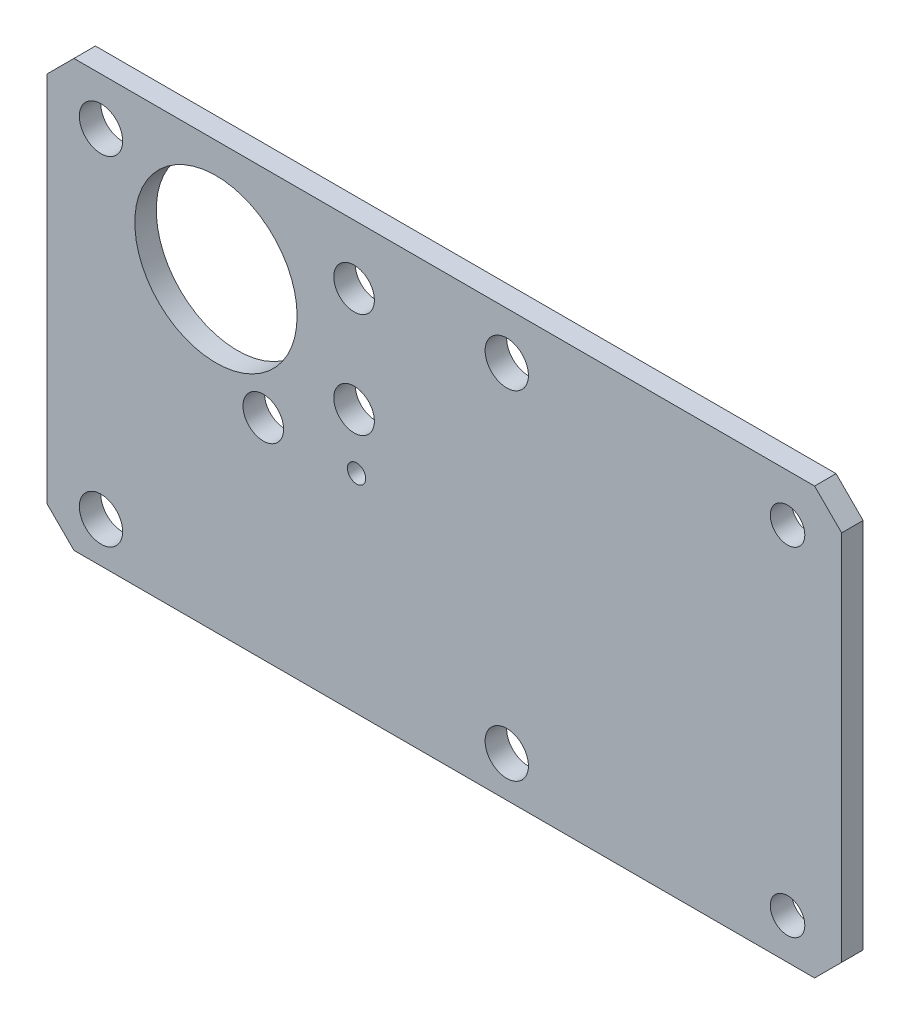
ISO-10303-21;
HEADER;
FILE_DESCRIPTION(('STEP AP214'),'2;1');
FILE_NAME('part.step','',(''),(''),'','','');
FILE_SCHEMA(('AUTOMOTIVE_DESIGN { 1 0 10303 214 1 1 1 1 }'));
ENDSEC;
DATA;
#1=APPLICATION_CONTEXT('core data for automotive mechanical design processes');
#2=APPLICATION_PROTOCOL_DEFINITION('international standard','automotive_design',2000,#1);
#3=PRODUCT_CONTEXT('',#1,'mechanical');
#4=PRODUCT('Part','Part','',(#3));
#5=PRODUCT_RELATED_PRODUCT_CATEGORY('part','',(#4));
#6=PRODUCT_DEFINITION_FORMATION('','',#4);
#7=PRODUCT_DEFINITION_CONTEXT('part definition',#1,'design');
#8=PRODUCT_DEFINITION('design','',#6,#7);
#9=PRODUCT_DEFINITION_SHAPE('','',#8);
#10=(LENGTH_UNIT() NAMED_UNIT(*) SI_UNIT(.MILLI.,.METRE.));
#11=(NAMED_UNIT(*) PLANE_ANGLE_UNIT() SI_UNIT($,.RADIAN.));
#12=(NAMED_UNIT(*) SI_UNIT($,.STERADIAN.) SOLID_ANGLE_UNIT());
#13=UNCERTAINTY_MEASURE_WITH_UNIT(LENGTH_MEASURE(1.E-05),#10,'distance_accuracy_value','');
#14=(GEOMETRIC_REPRESENTATION_CONTEXT(3) GLOBAL_UNCERTAINTY_ASSIGNED_CONTEXT((#13)) GLOBAL_UNIT_ASSIGNED_CONTEXT((#10,
#11,#12)) REPRESENTATION_CONTEXT('',''));
#15=CARTESIAN_POINT('',(0.,0.,0.));
#16=DIRECTION('',(0.,0.,1.));
#17=DIRECTION('',(1.,0.,0.));
#18=AXIS2_PLACEMENT_3D('',#15,#16,#17);
#19=CARTESIAN_POINT('',(-32.,-46.4999999899999,-3.175));
#20=DIRECTION('',(0.,-1.,0.));
#21=DIRECTION('',(1.,0.,0.));
#22=AXIS2_PLACEMENT_3D('',#19,#20,#21);
#23=PLANE('',#22);
#24=DIRECTION('',(1.,0.,0.));
#25=VECTOR('',#24,1.);
#26=CARTESIAN_POINT('',(-32.,-46.4999999899999,-3.175));
#27=LINE('',#26,#25);
#28=CARTESIAN_POINT('',(-28.,-46.4999999899999,-3.175));
#29=VERTEX_POINT('',#28);
#30=CARTESIAN_POINT('',(81.5160000000001,-46.4999999899999,-3.175));
#31=VERTEX_POINT('',#30);
#32=EDGE_CURVE('E165',#29,#31,#27,.T.);
#33=ORIENTED_EDGE('',*,*,#32,.T.);
#34=DIRECTION('',(0.,0.,1.));
#35=VECTOR('',#34,1.);
#36=CARTESIAN_POINT('',(81.5160000000001,-46.4999999899999,-3.175));
#37=LINE('',#36,#35);
#38=CARTESIAN_POINT('',(81.5160000000001,-46.4999999899999,0.));
#39=VERTEX_POINT('',#38);
#40=EDGE_CURVE('E120',#31,#39,#37,.T.);
#41=ORIENTED_EDGE('',*,*,#40,.T.);
#42=DIRECTION('',(1.,0.,0.));
#43=VECTOR('',#42,1.);
#44=CARTESIAN_POINT('',(-32.,-46.4999999899999,0.));
#45=LINE('',#44,#43);
#46=CARTESIAN_POINT('',(-28.,-46.4999999899999,0.));
#47=VERTEX_POINT('',#46);
#48=EDGE_CURVE('E105',#47,#39,#45,.T.);
#49=ORIENTED_EDGE('',*,*,#48,.F.);
#50=DIRECTION('',(0.,0.,-1.));
#51=VECTOR('',#50,1.);
#52=CARTESIAN_POINT('',(-28.,-46.4999999899999,-3.175));
#53=LINE('',#52,#51);
#54=EDGE_CURVE('E117',#47,#29,#53,.T.);
#55=ORIENTED_EDGE('',*,*,#54,.T.);
#56=EDGE_LOOP('',(#33,#41,#49,#55));
#57=FACE_BOUND('',#56,.T.);
#58=ADVANCED_FACE('F35',(#57),#23,.T.);
#59=CARTESIAN_POINT('',(-32.,16.5000000100001,-3.175));
#60=DIRECTION('',(-1.,0.,0.));
#61=DIRECTION('',(0.,-1.,0.));
#62=AXIS2_PLACEMENT_3D('',#59,#60,#61);
#63=PLANE('',#62);
#64=DIRECTION('',(0.,-1.,0.));
#65=VECTOR('',#64,1.);
#66=CARTESIAN_POINT('',(-32.,16.5000000100001,-3.175));
#67=LINE('',#66,#65);
#68=CARTESIAN_POINT('',(-32.,12.5000000100001,-3.175));
#69=VERTEX_POINT('',#68);
#70=CARTESIAN_POINT('',(-32.,-42.4999999899999,-3.175));
#71=VERTEX_POINT('',#70);
#72=EDGE_CURVE('E127',#69,#71,#67,.T.);
#73=ORIENTED_EDGE('',*,*,#72,.T.);
#74=DIRECTION('',(0.,0.,1.));
#75=VECTOR('',#74,1.);
#76=CARTESIAN_POINT('',(-32.,-42.4999999899999,-3.175));
#77=LINE('',#76,#75);
#78=CARTESIAN_POINT('',(-32.,-42.4999999899999,0.));
#79=VERTEX_POINT('',#78);
#80=EDGE_CURVE('E11',#71,#79,#77,.T.);
#81=ORIENTED_EDGE('',*,*,#80,.T.);
#82=DIRECTION('',(0.,-1.,0.));
#83=VECTOR('',#82,1.);
#84=CARTESIAN_POINT('',(-32.,16.5000000100001,0.));
#85=LINE('',#84,#83);
#86=CARTESIAN_POINT('',(-32.,12.5000000100001,0.));
#87=VERTEX_POINT('',#86);
#88=EDGE_CURVE('E107',#87,#79,#85,.T.);
#89=ORIENTED_EDGE('',*,*,#88,.F.);
#90=DIRECTION('',(0.,0.,-1.));
#91=VECTOR('',#90,1.);
#92=CARTESIAN_POINT('',(-32.,12.5000000100001,-3.175));
#93=LINE('',#92,#91);
#94=EDGE_CURVE('E43',#87,#69,#93,.T.);
#95=ORIENTED_EDGE('',*,*,#94,.T.);
#96=EDGE_LOOP('',(#73,#81,#89,#95));
#97=FACE_BOUND('',#96,.T.);
#98=ADVANCED_FACE('F156',(#97),#63,.T.);
#99=CARTESIAN_POINT('',(85.5160000000001,16.50000001,-3.175));
#100=DIRECTION('',(0.,1.,0.));
#101=DIRECTION('',(-1.,0.,0.));
#102=AXIS2_PLACEMENT_3D('',#99,#100,#101);
#103=PLANE('',#102);
#104=DIRECTION('',(-1.,0.,0.));
#105=VECTOR('',#104,1.);
#106=CARTESIAN_POINT('',(85.5160000000001,16.50000001,0.));
#107=LINE('',#106,#105);
#108=CARTESIAN_POINT('',(81.5160000000001,16.50000001,0.));
#109=VERTEX_POINT('',#108);
#110=CARTESIAN_POINT('',(-28.,16.5000000100001,0.));
#111=VERTEX_POINT('',#110);
#112=EDGE_CURVE('E163',#109,#111,#107,.T.);
#113=ORIENTED_EDGE('',*,*,#112,.F.);
#114=DIRECTION('',(0.,0.,-1.));
#115=VECTOR('',#114,1.);
#116=CARTESIAN_POINT('',(81.5160000000001,16.50000001,-3.175));
#117=LINE('',#116,#115);
#118=CARTESIAN_POINT('',(81.5160000000001,16.50000001,-3.175));
#119=VERTEX_POINT('',#118);
#120=EDGE_CURVE('E57',#109,#119,#117,.T.);
#121=ORIENTED_EDGE('',*,*,#120,.T.);
#122=DIRECTION('',(-1.,0.,0.));
#123=VECTOR('',#122,1.);
#124=CARTESIAN_POINT('',(85.5160000000001,16.50000001,-3.175));
#125=LINE('',#124,#123);
#126=CARTESIAN_POINT('',(-28.,16.5000000100001,-3.175));
#127=VERTEX_POINT('',#126);
#128=EDGE_CURVE('E131',#119,#127,#125,.T.);
#129=ORIENTED_EDGE('',*,*,#128,.T.);
#130=DIRECTION('',(0.,0.,1.));
#131=VECTOR('',#130,1.);
#132=CARTESIAN_POINT('',(-28.,16.5000000100001,-3.175));
#133=LINE('',#132,#131);
#134=EDGE_CURVE('E151',#127,#111,#133,.T.);
#135=ORIENTED_EDGE('',*,*,#134,.T.);
#136=EDGE_LOOP('',(#113,#121,#129,#135));
#137=FACE_BOUND('',#136,.T.);
#138=ADVANCED_FACE('F162',(#137),#103,.T.);
#139=CARTESIAN_POINT('',(85.5160000000001,-46.4999999899999,-3.175));
#140=DIRECTION('',(1.,0.,0.));
#141=DIRECTION('',(0.,1.,0.));
#142=AXIS2_PLACEMENT_3D('',#139,#140,#141);
#143=PLANE('',#142);
#144=DIRECTION('',(0.,1.,0.));
#145=VECTOR('',#144,1.);
#146=CARTESIAN_POINT('',(85.5160000000001,-46.4999999899999,0.));
#147=LINE('',#146,#145);
#148=CARTESIAN_POINT('',(85.5160000000001,-42.4999999899999,0.));
#149=VERTEX_POINT('',#148);
#150=CARTESIAN_POINT('',(85.5160000000001,12.50000001,0.));
#151=VERTEX_POINT('',#150);
#152=EDGE_CURVE('E121',#149,#151,#147,.T.);
#153=ORIENTED_EDGE('',*,*,#152,.F.);
#154=DIRECTION('',(0.,0.,-1.));
#155=VECTOR('',#154,1.);
#156=CARTESIAN_POINT('',(85.5160000000001,-42.4999999899999,-3.175));
#157=LINE('',#156,#155);
#158=CARTESIAN_POINT('',(85.5160000000001,-42.4999999899999,-3.175));
#159=VERTEX_POINT('',#158);
#160=EDGE_CURVE('E143',#149,#159,#157,.T.);
#161=ORIENTED_EDGE('',*,*,#160,.T.);
#162=DIRECTION('',(0.,1.,0.));
#163=VECTOR('',#162,1.);
#164=CARTESIAN_POINT('',(85.5160000000001,-46.4999999899999,-3.175));
#165=LINE('',#164,#163);
#166=CARTESIAN_POINT('',(85.5160000000001,12.50000001,-3.175));
#167=VERTEX_POINT('',#166);
#168=EDGE_CURVE('E169',#159,#167,#165,.T.);
#169=ORIENTED_EDGE('',*,*,#168,.T.);
#170=DIRECTION('',(0.,0.,1.));
#171=VECTOR('',#170,1.);
#172=CARTESIAN_POINT('',(85.5160000000001,12.50000001,-3.175));
#173=LINE('',#172,#171);
#174=EDGE_CURVE('E140',#167,#151,#173,.T.);
#175=ORIENTED_EDGE('',*,*,#174,.T.);
#176=EDGE_LOOP('',(#153,#161,#169,#175));
#177=FACE_BOUND('',#176,.T.);
#178=ADVANCED_FACE('F285',(#177),#143,.T.);
#179=CARTESIAN_POINT('',(0.,0.,-3.175));
#180=DIRECTION('',(0.,0.,1.));
#181=DIRECTION('',(1.,0.,0.));
#182=AXIS2_PLACEMENT_3D('',#179,#180,#181);
#183=PLANE('',#182);
#184=CARTESIAN_POINT('',(13.7908647204232,-15.7517999900003,-3.175));
#185=DIRECTION('',(0.,0.,1.));
#186=DIRECTION('',(1.,0.,0.));
#187=AXIS2_PLACEMENT_3D('',#184,#185,#186);
#188=CIRCLE('',#187,1.35254999999999);
#189=CARTESIAN_POINT('',(15.1434147204231,-15.7517999900003,-3.175));
#190=VERTEX_POINT('',#189);
#191=EDGE_CURVE('E232',#190,#190,#188,.T.);
#192=ORIENTED_EDGE('',*,*,#191,.T.);
#193=EDGE_LOOP('',(#192));
#194=FACE_BOUND('',#193,.T.);
#195=CARTESIAN_POINT('',(77.5160000000001,9.50000001000001,-3.175));
#196=DIRECTION('',(0.,0.,1.));
#197=DIRECTION('',(1.,0.,0.));
#198=AXIS2_PLACEMENT_3D('',#195,#196,#197);
#199=CIRCLE('',#198,2.55270000000001);
#200=CARTESIAN_POINT('',(80.0687000000001,9.50000001000001,-3.175));
#201=VERTEX_POINT('',#200);
#202=EDGE_CURVE('E226',#201,#201,#199,.T.);
#203=ORIENTED_EDGE('',*,*,#202,.T.);
#204=EDGE_LOOP('',(#203));
#205=FACE_BOUND('',#204,.T.);
#206=CARTESIAN_POINT('',(77.5160000000001,-40.49999999,-3.175));
#207=DIRECTION('',(0.,0.,1.));
#208=DIRECTION('',(1.,0.,0.));
#209=AXIS2_PLACEMENT_3D('',#206,#207,#208);
#210=CIRCLE('',#209,2.55270000000001);
#211=CARTESIAN_POINT('',(80.0687000000001,-40.49999999,-3.175));
#212=VERTEX_POINT('',#211);
#213=EDGE_CURVE('E218',#212,#212,#210,.T.);
#214=ORIENTED_EDGE('',*,*,#213,.T.);
#215=EDGE_LOOP('',(#214));
#216=FACE_BOUND('',#215,.T.);
#217=CARTESIAN_POINT('',(36.,9.50000001000001,-3.175));
#218=DIRECTION('',(0.,0.,1.));
#219=DIRECTION('',(1.,0.,0.));
#220=AXIS2_PLACEMENT_3D('',#217,#218,#219);
#221=CIRCLE('',#220,3.2004);
#222=CARTESIAN_POINT('',(39.2004,9.50000001000001,-3.175));
#223=VERTEX_POINT('',#222);
#224=EDGE_CURVE('E212',#223,#223,#221,.T.);
#225=ORIENTED_EDGE('',*,*,#224,.T.);
#226=EDGE_LOOP('',(#225));
#227=FACE_BOUND('',#226,.T.);
#228=CARTESIAN_POINT('',(36.,-40.49999999,-3.175));
#229=DIRECTION('',(0.,0.,1.));
#230=DIRECTION('',(1.,0.,0.));
#231=AXIS2_PLACEMENT_3D('',#228,#229,#230);
#232=CIRCLE('',#231,3.2004);
#233=CARTESIAN_POINT('',(39.2004,-40.49999999,-3.175));
#234=VERTEX_POINT('',#233);
#235=EDGE_CURVE('E206',#234,#234,#232,.T.);
#236=ORIENTED_EDGE('',*,*,#235,.T.);
#237=EDGE_LOOP('',(#236));
#238=FACE_BOUND('',#237,.T.);
#239=CARTESIAN_POINT('',(-24.,-40.49999999,-3.175));
#240=DIRECTION('',(0.,0.,1.));
#241=DIRECTION('',(1.,0.,0.));
#242=AXIS2_PLACEMENT_3D('',#239,#240,#241);
#243=CIRCLE('',#242,3.2004);
#244=CARTESIAN_POINT('',(-20.7996,-40.49999999,-3.175));
#245=VERTEX_POINT('',#244);
#246=EDGE_CURVE('E200',#245,#245,#243,.T.);
#247=ORIENTED_EDGE('',*,*,#246,.T.);
#248=EDGE_LOOP('',(#247));
#249=FACE_BOUND('',#248,.T.);
#250=CARTESIAN_POINT('',(-24.,9.50000001000001,-3.175));
#251=DIRECTION('',(0.,0.,1.));
#252=DIRECTION('',(1.,0.,0.));
#253=AXIS2_PLACEMENT_3D('',#250,#251,#252);
#254=CIRCLE('',#253,3.2004);
#255=CARTESIAN_POINT('',(-20.7996,9.50000001000001,-3.175));
#256=VERTEX_POINT('',#255);
#257=EDGE_CURVE('E194',#256,#256,#254,.T.);
#258=ORIENTED_EDGE('',*,*,#257,.T.);
#259=EDGE_LOOP('',(#258));
#260=FACE_BOUND('',#259,.T.);
#261=CARTESIAN_POINT('',(0.,-15.5,-3.175));
#262=DIRECTION('',(0.,0.,1.));
#263=DIRECTION('',(1.,0.,0.));
#264=AXIS2_PLACEMENT_3D('',#261,#262,#263);
#265=CIRCLE('',#264,3.);
#266=CARTESIAN_POINT('',(3.,-15.5,-3.175));
#267=VERTEX_POINT('',#266);
#268=EDGE_CURVE('E188',#267,#267,#265,.T.);
#269=ORIENTED_EDGE('',*,*,#268,.T.);
#270=EDGE_LOOP('',(#269));
#271=FACE_BOUND('',#270,.T.);
#272=CARTESIAN_POINT('',(-6.99999999999999,0.,-3.175));
#273=DIRECTION('',(0.,0.,1.));
#274=DIRECTION('',(1.,0.,0.));
#275=AXIS2_PLACEMENT_3D('',#272,#273,#274);
#276=CIRCLE('',#275,12.);
#277=CARTESIAN_POINT('',(5.00000000000001,0.,-3.175));
#278=VERTEX_POINT('',#277);
#279=EDGE_CURVE('E182',#278,#278,#276,.T.);
#280=ORIENTED_EDGE('',*,*,#279,.T.);
#281=EDGE_LOOP('',(#280));
#282=FACE_BOUND('',#281,.T.);
#283=CARTESIAN_POINT('',(13.4233937586589,-7.74999999999988,-3.175));
#284=DIRECTION('',(0.,0.,1.));
#285=DIRECTION('',(1.,0.,0.));
#286=AXIS2_PLACEMENT_3D('',#283,#284,#285);
#287=CIRCLE('',#286,3.);
#288=CARTESIAN_POINT('',(16.4233937586589,-7.74999999999988,-3.175));
#289=VERTEX_POINT('',#288);
#290=EDGE_CURVE('E176',#289,#289,#287,.T.);
#291=ORIENTED_EDGE('',*,*,#290,.T.);
#292=EDGE_LOOP('',(#291));
#293=FACE_BOUND('',#292,.T.);
#294=CARTESIAN_POINT('',(13.4233937586587,7.75000000000016,-3.175));
#295=DIRECTION('',(0.,0.,1.));
#296=DIRECTION('',(1.,0.,0.));
#297=AXIS2_PLACEMENT_3D('',#294,#295,#296);
#298=CIRCLE('',#297,3.);
#299=CARTESIAN_POINT('',(16.4233937586587,7.75000000000016,-3.175));
#300=VERTEX_POINT('',#299);
#301=EDGE_CURVE('E122',#300,#300,#298,.T.);
#302=ORIENTED_EDGE('',*,*,#301,.T.);
#303=EDGE_LOOP('',(#302));
#304=FACE_BOUND('',#303,.T.);
#305=ORIENTED_EDGE('',*,*,#168,.F.);
#306=DIRECTION('',(0.707106781186544,0.707106781186551,0.));
#307=VECTOR('',#306,1.);
#308=CARTESIAN_POINT('',(81.5160000000001,-46.4999999899999,-3.175));
#309=LINE('',#308,#307);
#310=EDGE_CURVE('E149',#159,#31,#309,.F.);
#311=ORIENTED_EDGE('',*,*,#310,.T.);
#312=ORIENTED_EDGE('',*,*,#32,.F.);
#313=DIRECTION('',(0.707106781186548,-0.707106781186547,0.));
#314=VECTOR('',#313,1.);
#315=CARTESIAN_POINT('',(-32.,-42.4999999899999,-3.175));
#316=LINE('',#315,#314);
#317=EDGE_CURVE('E126',#29,#71,#316,.F.);
#318=ORIENTED_EDGE('',*,*,#317,.T.);
#319=ORIENTED_EDGE('',*,*,#72,.F.);
#320=DIRECTION('',(-0.707106781186546,-0.707106781186549,0.));
#321=VECTOR('',#320,1.);
#322=CARTESIAN_POINT('',(-28.,16.5000000100001,-3.175));
#323=LINE('',#322,#321);
#324=EDGE_CURVE('E50',#69,#127,#323,.F.);
#325=ORIENTED_EDGE('',*,*,#324,.T.);
#326=ORIENTED_EDGE('',*,*,#128,.F.);
#327=DIRECTION('',(-0.707106781186548,0.707106781186548,0.));
#328=VECTOR('',#327,1.);
#329=CARTESIAN_POINT('',(85.5160000000001,12.50000001,-3.175));
#330=LINE('',#329,#328);
#331=EDGE_CURVE('E147',#119,#167,#330,.F.);
#332=ORIENTED_EDGE('',*,*,#331,.T.);
#333=EDGE_LOOP('',(#305,#311,#312,#318,#319,#325,#326,#332));
#334=FACE_BOUND('',#333,.T.);
#335=ADVANCED_FACE('F159',(#194,#205,#216,#227,#238,#249,#260,#271,#282,#293,#304,#334),#183,.F.);
#336=CARTESIAN_POINT('',(0.,0.,0.));
#337=DIRECTION('',(0.,0.,1.));
#338=DIRECTION('',(1.,0.,0.));
#339=AXIS2_PLACEMENT_3D('',#336,#337,#338);
#340=PLANE('',#339);
#341=CARTESIAN_POINT('',(13.7908647204232,-15.7517999900003,0.));
#342=DIRECTION('',(0.,0.,1.));
#343=DIRECTION('',(1.,0.,0.));
#344=AXIS2_PLACEMENT_3D('',#341,#342,#343);
#345=CIRCLE('',#344,1.35254999999999);
#346=CARTESIAN_POINT('',(15.1434147204231,-15.7517999900003,0.));
#347=VERTEX_POINT('',#346);
#348=EDGE_CURVE('E235',#347,#347,#345,.T.);
#349=ORIENTED_EDGE('',*,*,#348,.F.);
#350=EDGE_LOOP('',(#349));
#351=FACE_BOUND('',#350,.T.);
#352=CARTESIAN_POINT('',(77.5160000000001,9.50000001000001,0.));
#353=DIRECTION('',(0.,0.,1.));
#354=DIRECTION('',(1.,0.,0.));
#355=AXIS2_PLACEMENT_3D('',#352,#353,#354);
#356=CIRCLE('',#355,2.55269999999999);
#357=CARTESIAN_POINT('',(80.0687000000001,9.50000001000001,0.));
#358=VERTEX_POINT('',#357);
#359=EDGE_CURVE('E229',#358,#358,#356,.T.);
#360=ORIENTED_EDGE('',*,*,#359,.F.);
#361=EDGE_LOOP('',(#360));
#362=FACE_BOUND('',#361,.T.);
#363=CARTESIAN_POINT('',(77.5160000000001,-40.49999999,0.));
#364=DIRECTION('',(0.,0.,1.));
#365=DIRECTION('',(1.,0.,0.));
#366=AXIS2_PLACEMENT_3D('',#363,#364,#365);
#367=CIRCLE('',#366,2.55269999999999);
#368=CARTESIAN_POINT('',(80.0687000000001,-40.49999999,0.));
#369=VERTEX_POINT('',#368);
#370=EDGE_CURVE('E223',#369,#369,#367,.T.);
#371=ORIENTED_EDGE('',*,*,#370,.F.);
#372=EDGE_LOOP('',(#371));
#373=FACE_BOUND('',#372,.T.);
#374=CARTESIAN_POINT('',(36.,9.50000001000001,0.));
#375=DIRECTION('',(0.,0.,1.));
#376=DIRECTION('',(1.,0.,0.));
#377=AXIS2_PLACEMENT_3D('',#374,#375,#376);
#378=CIRCLE('',#377,3.2004);
#379=CARTESIAN_POINT('',(39.2004,9.50000001000001,0.));
#380=VERTEX_POINT('',#379);
#381=EDGE_CURVE('E215',#380,#380,#378,.T.);
#382=ORIENTED_EDGE('',*,*,#381,.F.);
#383=EDGE_LOOP('',(#382));
#384=FACE_BOUND('',#383,.T.);
#385=CARTESIAN_POINT('',(36.,-40.49999999,0.));
#386=DIRECTION('',(0.,0.,1.));
#387=DIRECTION('',(1.,0.,0.));
#388=AXIS2_PLACEMENT_3D('',#385,#386,#387);
#389=CIRCLE('',#388,3.2004);
#390=CARTESIAN_POINT('',(39.2004,-40.49999999,0.));
#391=VERTEX_POINT('',#390);
#392=EDGE_CURVE('E209',#391,#391,#389,.T.);
#393=ORIENTED_EDGE('',*,*,#392,.F.);
#394=EDGE_LOOP('',(#393));
#395=FACE_BOUND('',#394,.T.);
#396=CARTESIAN_POINT('',(-24.,-40.49999999,0.));
#397=DIRECTION('',(0.,0.,1.));
#398=DIRECTION('',(1.,0.,0.));
#399=AXIS2_PLACEMENT_3D('',#396,#397,#398);
#400=CIRCLE('',#399,3.2004);
#401=CARTESIAN_POINT('',(-20.7996,-40.49999999,0.));
#402=VERTEX_POINT('',#401);
#403=EDGE_CURVE('E203',#402,#402,#400,.T.);
#404=ORIENTED_EDGE('',*,*,#403,.F.);
#405=EDGE_LOOP('',(#404));
#406=FACE_BOUND('',#405,.T.);
#407=CARTESIAN_POINT('',(-24.,9.50000001000001,0.));
#408=DIRECTION('',(0.,0.,1.));
#409=DIRECTION('',(1.,0.,0.));
#410=AXIS2_PLACEMENT_3D('',#407,#408,#409);
#411=CIRCLE('',#410,3.2004);
#412=CARTESIAN_POINT('',(-20.7996,9.50000001000001,0.));
#413=VERTEX_POINT('',#412);
#414=EDGE_CURVE('E197',#413,#413,#411,.T.);
#415=ORIENTED_EDGE('',*,*,#414,.F.);
#416=EDGE_LOOP('',(#415));
#417=FACE_BOUND('',#416,.T.);
#418=CARTESIAN_POINT('',(0.,-15.5,0.));
#419=DIRECTION('',(0.,0.,1.));
#420=DIRECTION('',(1.,0.,0.));
#421=AXIS2_PLACEMENT_3D('',#418,#419,#420);
#422=CIRCLE('',#421,3.);
#423=CARTESIAN_POINT('',(3.,-15.5,0.));
#424=VERTEX_POINT('',#423);
#425=EDGE_CURVE('E191',#424,#424,#422,.T.);
#426=ORIENTED_EDGE('',*,*,#425,.F.);
#427=EDGE_LOOP('',(#426));
#428=FACE_BOUND('',#427,.T.);
#429=CARTESIAN_POINT('',(-6.99999999999999,0.,0.));
#430=DIRECTION('',(0.,0.,1.));
#431=DIRECTION('',(1.,0.,0.));
#432=AXIS2_PLACEMENT_3D('',#429,#430,#431);
#433=CIRCLE('',#432,12.);
#434=CARTESIAN_POINT('',(5.00000000000001,0.,0.));
#435=VERTEX_POINT('',#434);
#436=EDGE_CURVE('E185',#435,#435,#433,.T.);
#437=ORIENTED_EDGE('',*,*,#436,.F.);
#438=EDGE_LOOP('',(#437));
#439=FACE_BOUND('',#438,.T.);
#440=CARTESIAN_POINT('',(13.4233937586589,-7.74999999999988,0.));
#441=DIRECTION('',(0.,0.,1.));
#442=DIRECTION('',(1.,0.,0.));
#443=AXIS2_PLACEMENT_3D('',#440,#441,#442);
#444=CIRCLE('',#443,3.);
#445=CARTESIAN_POINT('',(16.4233937586589,-7.74999999999988,0.));
#446=VERTEX_POINT('',#445);
#447=EDGE_CURVE('E179',#446,#446,#444,.T.);
#448=ORIENTED_EDGE('',*,*,#447,.F.);
#449=EDGE_LOOP('',(#448));
#450=FACE_BOUND('',#449,.T.);
#451=CARTESIAN_POINT('',(13.4233937586587,7.75000000000016,0.));
#452=DIRECTION('',(0.,0.,1.));
#453=DIRECTION('',(1.,0.,0.));
#454=AXIS2_PLACEMENT_3D('',#451,#452,#453);
#455=CIRCLE('',#454,3.);
#456=CARTESIAN_POINT('',(16.4233937586587,7.75000000000016,0.));
#457=VERTEX_POINT('',#456);
#458=EDGE_CURVE('E173',#457,#457,#455,.T.);
#459=ORIENTED_EDGE('',*,*,#458,.F.);
#460=EDGE_LOOP('',(#459));
#461=FACE_BOUND('',#460,.T.);
#462=ORIENTED_EDGE('',*,*,#48,.T.);
#463=DIRECTION('',(-0.707106781186544,-0.707106781186551,0.));
#464=VECTOR('',#463,1.);
#465=CARTESIAN_POINT('',(64.0079999950005,-64.0079999949998,0.));
#466=LINE('',#465,#464);
#467=EDGE_CURVE('E138',#39,#149,#466,.F.);
#468=ORIENTED_EDGE('',*,*,#467,.T.);
#469=ORIENTED_EDGE('',*,*,#152,.T.);
#470=DIRECTION('',(0.707106781186548,-0.707106781186548,0.));
#471=VECTOR('',#470,1.);
#472=CARTESIAN_POINT('',(49.008000005,49.008000005,0.));
#473=LINE('',#472,#471);
#474=EDGE_CURVE('E111',#151,#109,#473,.F.);
#475=ORIENTED_EDGE('',*,*,#474,.T.);
#476=ORIENTED_EDGE('',*,*,#112,.T.);
#477=DIRECTION('',(0.707106781186546,0.707106781186549,0.));
#478=VECTOR('',#477,1.);
#479=CARTESIAN_POINT('',(-22.2500000050001,22.250000005,0.));
#480=LINE('',#479,#478);
#481=EDGE_CURVE('E112',#111,#87,#480,.F.);
#482=ORIENTED_EDGE('',*,*,#481,.T.);
#483=ORIENTED_EDGE('',*,*,#88,.T.);
#484=DIRECTION('',(-0.707106781186548,0.707106781186547,0.));
#485=VECTOR('',#484,1.);
#486=CARTESIAN_POINT('',(-37.2499999949999,-37.249999995,0.));
#487=LINE('',#486,#485);
#488=EDGE_CURVE('E102',#79,#47,#487,.F.);
#489=ORIENTED_EDGE('',*,*,#488,.T.);
#490=EDGE_LOOP('',(#462,#468,#469,#475,#476,#482,#483,#489));
#491=FACE_BOUND('',#490,.T.);
#492=ADVANCED_FACE('F104',(#351,#362,#373,#384,#395,#406,#417,#428,#439,#450,#461,#491),#340,.T.);
#493=CARTESIAN_POINT('',(13.4233937586587,7.75000000000016,-3.175));
#494=DIRECTION('',(0.,0.,1.));
#495=DIRECTION('',(1.,0.,0.));
#496=AXIS2_PLACEMENT_3D('',#493,#494,#495);
#497=CYLINDRICAL_SURFACE('',#496,3.);
#498=ORIENTED_EDGE('',*,*,#301,.F.);
#499=EDGE_LOOP('',(#498));
#500=FACE_BOUND('',#499,.T.);
#501=ORIENTED_EDGE('',*,*,#458,.T.);
#502=EDGE_LOOP('',(#501));
#503=FACE_BOUND('',#502,.T.);
#504=ADVANCED_FACE('F243',(#500,#503),#497,.F.);
#505=CARTESIAN_POINT('',(13.4233937586589,-7.74999999999988,-3.175));
#506=DIRECTION('',(0.,0.,1.));
#507=DIRECTION('',(1.,0.,0.));
#508=AXIS2_PLACEMENT_3D('',#505,#506,#507);
#509=CYLINDRICAL_SURFACE('',#508,3.);
#510=ORIENTED_EDGE('',*,*,#290,.F.);
#511=EDGE_LOOP('',(#510));
#512=FACE_BOUND('',#511,.T.);
#513=ORIENTED_EDGE('',*,*,#447,.T.);
#514=EDGE_LOOP('',(#513));
#515=FACE_BOUND('',#514,.T.);
#516=ADVANCED_FACE('F266',(#512,#515),#509,.F.);
#517=CARTESIAN_POINT('',(-6.99999999999999,0.,-3.175));
#518=DIRECTION('',(0.,0.,1.));
#519=DIRECTION('',(1.,0.,0.));
#520=AXIS2_PLACEMENT_3D('',#517,#518,#519);
#521=CYLINDRICAL_SURFACE('',#520,12.);
#522=ORIENTED_EDGE('',*,*,#279,.F.);
#523=EDGE_LOOP('',(#522));
#524=FACE_BOUND('',#523,.T.);
#525=ORIENTED_EDGE('',*,*,#436,.T.);
#526=EDGE_LOOP('',(#525));
#527=FACE_BOUND('',#526,.T.);
#528=ADVANCED_FACE('F272',(#524,#527),#521,.F.);
#529=CARTESIAN_POINT('',(0.,-15.5,-3.175));
#530=DIRECTION('',(0.,0.,1.));
#531=DIRECTION('',(1.,0.,0.));
#532=AXIS2_PLACEMENT_3D('',#529,#530,#531);
#533=CYLINDRICAL_SURFACE('',#532,3.);
#534=ORIENTED_EDGE('',*,*,#268,.F.);
#535=EDGE_LOOP('',(#534));
#536=FACE_BOUND('',#535,.T.);
#537=ORIENTED_EDGE('',*,*,#425,.T.);
#538=EDGE_LOOP('',(#537));
#539=FACE_BOUND('',#538,.T.);
#540=ADVANCED_FACE('F329',(#536,#539),#533,.F.);
#541=CARTESIAN_POINT('',(-24.,9.50000001000001,-3.175));
#542=DIRECTION('',(0.,0.,1.));
#543=DIRECTION('',(1.,0.,0.));
#544=AXIS2_PLACEMENT_3D('',#541,#542,#543);
#545=CYLINDRICAL_SURFACE('',#544,3.2004);
#546=ORIENTED_EDGE('',*,*,#257,.F.);
#547=EDGE_LOOP('',(#546));
#548=FACE_BOUND('',#547,.T.);
#549=ORIENTED_EDGE('',*,*,#414,.T.);
#550=EDGE_LOOP('',(#549));
#551=FACE_BOUND('',#550,.T.);
#552=ADVANCED_FACE('F325',(#548,#551),#545,.F.);
#553=CARTESIAN_POINT('',(-24.,-40.49999999,-3.175));
#554=DIRECTION('',(0.,0.,1.));
#555=DIRECTION('',(1.,0.,0.));
#556=AXIS2_PLACEMENT_3D('',#553,#554,#555);
#557=CYLINDRICAL_SURFACE('',#556,3.2004);
#558=ORIENTED_EDGE('',*,*,#246,.F.);
#559=EDGE_LOOP('',(#558));
#560=FACE_BOUND('',#559,.T.);
#561=ORIENTED_EDGE('',*,*,#403,.T.);
#562=EDGE_LOOP('',(#561));
#563=FACE_BOUND('',#562,.T.);
#564=ADVANCED_FACE('F321',(#560,#563),#557,.F.);
#565=CARTESIAN_POINT('',(36.,-40.49999999,-3.175));
#566=DIRECTION('',(0.,0.,1.));
#567=DIRECTION('',(1.,0.,0.));
#568=AXIS2_PLACEMENT_3D('',#565,#566,#567);
#569=CYLINDRICAL_SURFACE('',#568,3.2004);
#570=ORIENTED_EDGE('',*,*,#235,.F.);
#571=EDGE_LOOP('',(#570));
#572=FACE_BOUND('',#571,.T.);
#573=ORIENTED_EDGE('',*,*,#392,.T.);
#574=EDGE_LOOP('',(#573));
#575=FACE_BOUND('',#574,.T.);
#576=ADVANCED_FACE('F317',(#572,#575),#569,.F.);
#577=CARTESIAN_POINT('',(36.,9.50000001000001,-3.175));
#578=DIRECTION('',(0.,0.,1.));
#579=DIRECTION('',(1.,0.,0.));
#580=AXIS2_PLACEMENT_3D('',#577,#578,#579);
#581=CYLINDRICAL_SURFACE('',#580,3.2004);
#582=ORIENTED_EDGE('',*,*,#224,.F.);
#583=EDGE_LOOP('',(#582));
#584=FACE_BOUND('',#583,.T.);
#585=ORIENTED_EDGE('',*,*,#381,.T.);
#586=EDGE_LOOP('',(#585));
#587=FACE_BOUND('',#586,.T.);
#588=ADVANCED_FACE('F291',(#584,#587),#581,.F.);
#589=CARTESIAN_POINT('',(81.5160000000001,-46.4999999899999,-3.175));
#590=DIRECTION('',(-0.707106781186551,0.707106781186544,0.));
#591=DIRECTION('',(0.,0.,1.));
#592=AXIS2_PLACEMENT_3D('',#589,#590,#591);
#593=PLANE('',#592);
#594=ORIENTED_EDGE('',*,*,#310,.F.);
#595=ORIENTED_EDGE('',*,*,#160,.F.);
#596=ORIENTED_EDGE('',*,*,#467,.F.);
#597=ORIENTED_EDGE('',*,*,#40,.F.);
#598=EDGE_LOOP('',(#594,#595,#596,#597));
#599=FACE_BOUND('',#598,.T.);
#600=ADVANCED_FACE('F287',(#599),#593,.F.);
#601=CARTESIAN_POINT('',(85.5160000000001,12.50000001,-3.175));
#602=DIRECTION('',(-0.707106781186547,-0.707106781186547,0.));
#603=DIRECTION('',(0.,0.,1.));
#604=AXIS2_PLACEMENT_3D('',#601,#602,#603);
#605=PLANE('',#604);
#606=ORIENTED_EDGE('',*,*,#331,.F.);
#607=ORIENTED_EDGE('',*,*,#120,.F.);
#608=ORIENTED_EDGE('',*,*,#474,.F.);
#609=ORIENTED_EDGE('',*,*,#174,.F.);
#610=EDGE_LOOP('',(#606,#607,#608,#609));
#611=FACE_BOUND('',#610,.T.);
#612=ADVANCED_FACE('F290',(#611),#605,.F.);
#613=CARTESIAN_POINT('',(-32.,-42.4999999899999,-3.175));
#614=DIRECTION('',(0.707106781186547,0.707106781186548,0.));
#615=DIRECTION('',(0.,0.,1.));
#616=AXIS2_PLACEMENT_3D('',#613,#614,#615);
#617=PLANE('',#616);
#618=ORIENTED_EDGE('',*,*,#317,.F.);
#619=ORIENTED_EDGE('',*,*,#54,.F.);
#620=ORIENTED_EDGE('',*,*,#488,.F.);
#621=ORIENTED_EDGE('',*,*,#80,.F.);
#622=EDGE_LOOP('',(#618,#619,#620,#621));
#623=FACE_BOUND('',#622,.T.);
#624=ADVANCED_FACE('F125',(#623),#617,.F.);
#625=CARTESIAN_POINT('',(-28.,16.5000000100001,-3.175));
#626=DIRECTION('',(0.707106781186549,-0.707106781186546,0.));
#627=DIRECTION('',(0.,0.,1.));
#628=AXIS2_PLACEMENT_3D('',#625,#626,#627);
#629=PLANE('',#628);
#630=ORIENTED_EDGE('',*,*,#324,.F.);
#631=ORIENTED_EDGE('',*,*,#94,.F.);
#632=ORIENTED_EDGE('',*,*,#481,.F.);
#633=ORIENTED_EDGE('',*,*,#134,.F.);
#634=EDGE_LOOP('',(#630,#631,#632,#633));
#635=FACE_BOUND('',#634,.T.);
#636=ADVANCED_FACE('F37',(#635),#629,.F.);
#637=CARTESIAN_POINT('',(77.5160000000001,-40.49999999,0.));
#638=DIRECTION('',(0.,0.,1.));
#639=DIRECTION('',(1.,0.,0.));
#640=AXIS2_PLACEMENT_3D('',#637,#638,#639);
#641=CYLINDRICAL_SURFACE('',#640,2.5527);
#642=ORIENTED_EDGE('',*,*,#213,.F.);
#643=EDGE_LOOP('',(#642));
#644=FACE_BOUND('',#643,.T.);
#645=ORIENTED_EDGE('',*,*,#370,.T.);
#646=EDGE_LOOP('',(#645));
#647=FACE_BOUND('',#646,.T.);
#648=ADVANCED_FACE('F299',(#644,#647),#641,.F.);
#649=CARTESIAN_POINT('',(77.5160000000001,9.50000001000001,0.));
#650=DIRECTION('',(0.,0.,1.));
#651=DIRECTION('',(1.,0.,0.));
#652=AXIS2_PLACEMENT_3D('',#649,#650,#651);
#653=CYLINDRICAL_SURFACE('',#652,2.5527);
#654=ORIENTED_EDGE('',*,*,#202,.F.);
#655=EDGE_LOOP('',(#654));
#656=FACE_BOUND('',#655,.T.);
#657=ORIENTED_EDGE('',*,*,#359,.T.);
#658=EDGE_LOOP('',(#657));
#659=FACE_BOUND('',#658,.T.);
#660=ADVANCED_FACE('F303',(#656,#659),#653,.F.);
#661=CARTESIAN_POINT('',(13.7908647204232,-15.7517999900003,0.));
#662=DIRECTION('',(0.,0.,1.));
#663=DIRECTION('',(1.,0.,0.));
#664=AXIS2_PLACEMENT_3D('',#661,#662,#663);
#665=CYLINDRICAL_SURFACE('',#664,1.35254999999999);
#666=ORIENTED_EDGE('',*,*,#191,.F.);
#667=EDGE_LOOP('',(#666));
#668=FACE_BOUND('',#667,.T.);
#669=ORIENTED_EDGE('',*,*,#348,.T.);
#670=EDGE_LOOP('',(#669));
#671=FACE_BOUND('',#670,.T.);
#672=ADVANCED_FACE('F239',(#668,#671),#665,.F.);
#673=CLOSED_SHELL('',(#58,#98,#138,#178,#335,#492,#504,#516,#528,#540,#552,#564,#576,#588,#600,
#612,#624,#636,#648,#660,#672));
#674=MANIFOLD_SOLID_BREP('B2',#673);
#675=ADVANCED_BREP_SHAPE_REPRESENTATION('',(#18,#674),#14);
#676=SHAPE_DEFINITION_REPRESENTATION(#9,#675);
ENDSEC;
END-ISO-10303-21;
